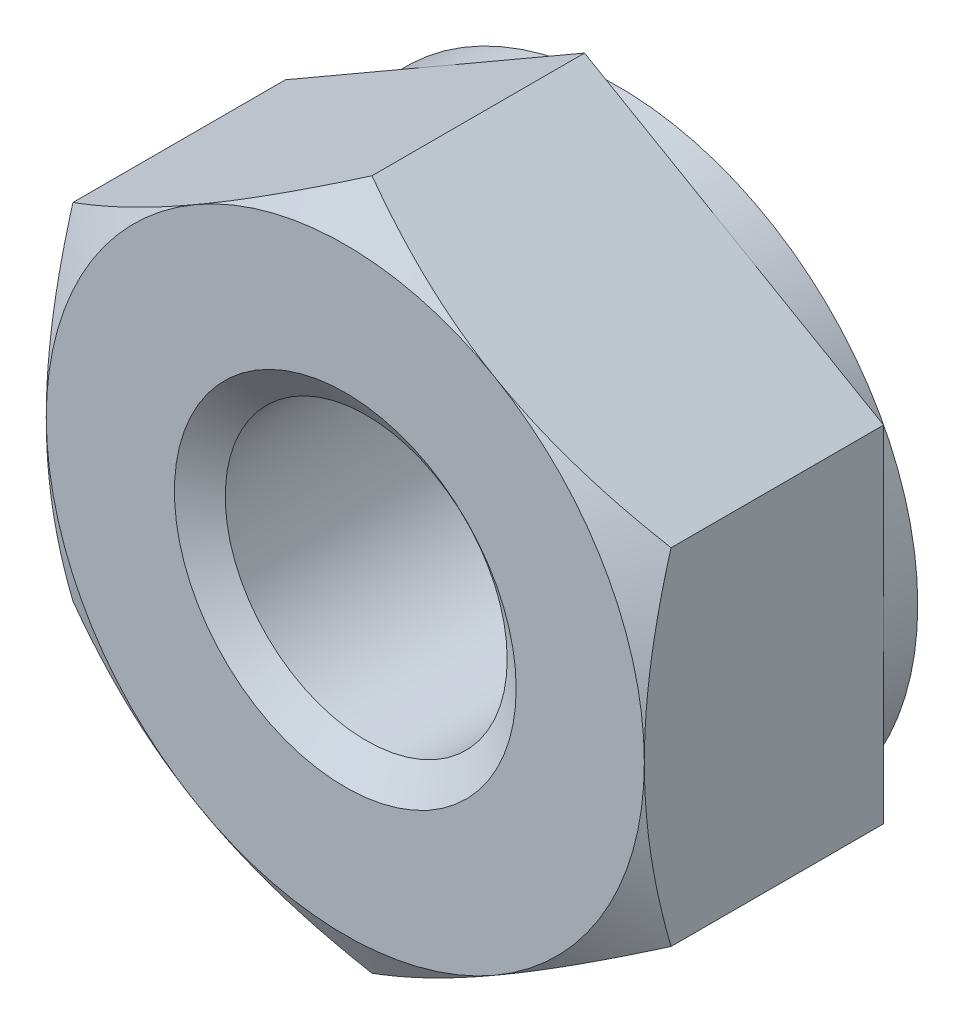
ISO-10303-21;
HEADER;
FILE_DESCRIPTION(('STEP AP214'),'2;1');
FILE_NAME('part.step','',(''),(''),'','','');
FILE_SCHEMA(('AUTOMOTIVE_DESIGN { 1 0 10303 214 1 1 1 1 }'));
ENDSEC;
DATA;
#1=APPLICATION_CONTEXT('core data for automotive mechanical design processes');
#2=APPLICATION_PROTOCOL_DEFINITION('international standard','automotive_design',2000,#1);
#3=PRODUCT_CONTEXT('',#1,'mechanical');
#4=PRODUCT('Part','Part','',(#3));
#5=PRODUCT_RELATED_PRODUCT_CATEGORY('part','',(#4));
#6=PRODUCT_DEFINITION_FORMATION('','',#4);
#7=PRODUCT_DEFINITION_CONTEXT('part definition',#1,'design');
#8=PRODUCT_DEFINITION('design','',#6,#7);
#9=PRODUCT_DEFINITION_SHAPE('','',#8);
#10=(LENGTH_UNIT() NAMED_UNIT(*) SI_UNIT(.MILLI.,.METRE.));
#11=(NAMED_UNIT(*) PLANE_ANGLE_UNIT() SI_UNIT($,.RADIAN.));
#12=(NAMED_UNIT(*) SI_UNIT($,.STERADIAN.) SOLID_ANGLE_UNIT());
#13=UNCERTAINTY_MEASURE_WITH_UNIT(LENGTH_MEASURE(1.E-05),#10,'distance_accuracy_value','');
#14=(GEOMETRIC_REPRESENTATION_CONTEXT(3) GLOBAL_UNCERTAINTY_ASSIGNED_CONTEXT((#13)) GLOBAL_UNIT_ASSIGNED_CONTEXT((#10,
#11,#12)) REPRESENTATION_CONTEXT('',''));
#15=CARTESIAN_POINT('',(0.,0.,0.));
#16=DIRECTION('',(0.,0.,1.));
#17=DIRECTION('',(1.,0.,0.));
#18=AXIS2_PLACEMENT_3D('',#15,#16,#17);
#19=CARTESIAN_POINT('',(0.,0.,-3.2));
#20=DIRECTION('',(0.,0.,1.));
#21=DIRECTION('',(1.,0.,0.));
#22=AXIS2_PLACEMENT_3D('',#19,#20,#21);
#23=CYLINDRICAL_SURFACE('',#22,1.65);
#24=CARTESIAN_POINT('',(0.,0.,-0.2450726383734));
#25=DIRECTION('',(0.,0.,1.));
#26=DIRECTION('',(1.,0.,0.));
#27=AXIS2_PLACEMENT_3D('',#24,#25,#26);
#28=CIRCLE('',#27,1.65);
#29=CARTESIAN_POINT('',(1.65,0.,-0.2450726383734));
#30=VERTEX_POINT('',#29);
#31=EDGE_CURVE('E153',#30,#30,#28,.F.);
#32=ORIENTED_EDGE('',*,*,#31,.F.);
#33=EDGE_LOOP('',(#32));
#34=FACE_BOUND('',#33,.T.);
#35=CARTESIAN_POINT('',(0.,0.,-2.9295273616266));
#36=DIRECTION('',(0.,0.,-1.));
#37=DIRECTION('',(-1.,0.,0.));
#38=AXIS2_PLACEMENT_3D('',#35,#36,#37);
#39=CIRCLE('',#38,1.65);
#40=CARTESIAN_POINT('',(-1.65,0.,-2.9295273616266));
#41=VERTEX_POINT('',#40);
#42=EDGE_CURVE('E41',#41,#41,#39,.F.);
#43=ORIENTED_EDGE('',*,*,#42,.F.);
#44=EDGE_LOOP('',(#43));
#45=FACE_BOUND('',#44,.T.);
#46=ADVANCED_FACE('F36',(#34,#45),#23,.F.);
#47=CARTESIAN_POINT('',(0.,4.0414518843274,-3.2));
#48=DIRECTION('',(-0.500000000000005,0.866025403784436,0.));
#49=DIRECTION('',(-0.866025403784436,-0.500000000000005,0.));
#50=AXIS2_PLACEMENT_3D('',#47,#48,#49);
#51=PLANE('',#50);
#52=DIRECTION('',(0.,0.,1.));
#53=VECTOR('',#52,1.);
#54=CARTESIAN_POINT('',(-3.5,2.02072594216368,-3.2));
#55=LINE('',#54,#53);
#56=CARTESIAN_POINT('',(-3.5,2.02072594216368,-2.8));
#57=VERTEX_POINT('',#56);
#58=CARTESIAN_POINT('',(-3.5,2.02072594216368,-0.312607391169654));
#59=VERTEX_POINT('',#58);
#60=EDGE_CURVE('E291',#57,#59,#55,.T.);
#61=ORIENTED_EDGE('',*,*,#60,.T.);
#62=CARTESIAN_POINT('',(-3.5002,2.02061047210984,-0.312674060693369));
#63=CARTESIAN_POINT('',(-3.34639282154755,2.10941108799266,-0.261385788989981));
#64=CARTESIAN_POINT('',(-3.19125798916558,2.19897822522908,-0.214740953816195));
#65=CARTESIAN_POINT('',(-2.87830199342322,2.37966345361544,-0.133321875533347));
#66=CARTESIAN_POINT('',(-2.72047526921251,2.47078475532382,-0.0985764355845604));
#67=CARTESIAN_POINT('',(-2.40677778961988,2.65189807961073,-0.0444900271828359));
#68=CARTESIAN_POINT('',(-2.25095530083931,2.74186223545399,-0.0247890862603818));
#69=CARTESIAN_POINT('',(-1.93857711279463,2.92221386641055,-0.00127013273725549));
#70=CARTESIAN_POINT('',(-1.78202254896578,3.01260068598001,0.00256735545443312));
#71=CARTESIAN_POINT('',(-1.48949078007902,3.1814939814933,-0.00541530187698026));
#72=CARTESIAN_POINT('',(-1.3534697875421,3.26002573814993,-0.0152754340696102));
#73=CARTESIAN_POINT('',(-1.08231397971101,3.41657761679354,-0.0465264668994079));
#74=CARTESIAN_POINT('',(-0.947180102315322,3.49459719728458,-0.0679280432858034));
#75=CARTESIAN_POINT('',(-0.67546520759482,3.6514718648943,-0.121430407880584));
#76=CARTESIAN_POINT('',(-0.538918580721667,3.73030709667645,-0.153757994445094));
#77=CARTESIAN_POINT('',(-0.2678619070555,3.88680174018326,-0.227128933808003));
#78=CARTESIAN_POINT('',(-0.133348387531465,3.9644631568901,-0.268155046569876));
#79=CARTESIAN_POINT('',(0.000199999999998829,4.04156735438124,-0.312674060693381));
#80=B_SPLINE_CURVE_WITH_KNOTS('',3,(#62,#63,#64,#65,#66,#67,#68,#69,#70,#71,#72,#73,#74,#75,#76,
#77,#78,#79),.UNSPECIFIED.,.F.,.F.,(4,2,2,2,2,2,2,2,4),(0.,0.554793832886253,1.11092123814984,
1.65328467083219,2.19498204478403,2.6666513085086,3.13875761298268,3.62133612600511,
4.10296698719188),.UNSPECIFIED.);
#81=CARTESIAN_POINT('',(-1.75000000000002,3.03108891324552,0.));
#82=VERTEX_POINT('',#81);
#83=EDGE_CURVE('E139',#59,#82,#80,.T.);
#84=ORIENTED_EDGE('',*,*,#83,.T.);
#85=CARTESIAN_POINT('',(0.,4.0414518843274,-0.312607391169653));
#86=VERTEX_POINT('',#85);
#87=EDGE_CURVE('E166',#82,#86,#80,.T.);
#88=ORIENTED_EDGE('',*,*,#87,.T.);
#89=DIRECTION('',(0.,0.,1.));
#90=VECTOR('',#89,1.);
#91=CARTESIAN_POINT('',(0.,4.0414518843274,-3.2));
#92=LINE('',#91,#90);
#93=CARTESIAN_POINT('',(0.,4.0414518843274,-2.8));
#94=VERTEX_POINT('',#93);
#95=EDGE_CURVE('E279',#94,#86,#92,.T.);
#96=ORIENTED_EDGE('',*,*,#95,.F.);
#97=DIRECTION('',(-0.866025403784436,-0.500000000000005,0.));
#98=VECTOR('',#97,1.);
#99=CARTESIAN_POINT('',(0.,4.0414518843274,-2.8));
#100=LINE('',#99,#98);
#101=CARTESIAN_POINT('',(-1.75000000000002,3.03108891324553,-2.8));
#102=VERTEX_POINT('',#101);
#103=EDGE_CURVE('E267',#94,#102,#100,.T.);
#104=ORIENTED_EDGE('',*,*,#103,.T.);
#105=EDGE_CURVE('E263',#102,#57,#100,.T.);
#106=ORIENTED_EDGE('',*,*,#105,.T.);
#107=EDGE_LOOP('',(#61,#84,#88,#96,#104,#106));
#108=FACE_BOUND('',#107,.T.);
#109=ADVANCED_FACE('F38',(#108),#51,.T.);
#110=CARTESIAN_POINT('',(3.5,2.02072594216367,-3.2));
#111=DIRECTION('',(0.500000000000006,0.866025403784435,0.));
#112=DIRECTION('',(-0.866025403784435,0.500000000000006,0.));
#113=AXIS2_PLACEMENT_3D('',#110,#111,#112);
#114=PLANE('',#113);
#115=ORIENTED_EDGE('',*,*,#95,.T.);
#116=CARTESIAN_POINT('',(-0.000200000000001219,4.04156735438124,-0.312674060693381));
#117=CARTESIAN_POINT('',(0.153607178452449,3.95276673849842,-0.261385788989993));
#118=CARTESIAN_POINT('',(0.308742010834423,3.86319960126199,-0.214740953816206));
#119=CARTESIAN_POINT('',(0.62169800657678,3.68251437287563,-0.133321875533355));
#120=CARTESIAN_POINT('',(0.779524730787494,3.59139307116726,-0.0985764355845668));
#121=CARTESIAN_POINT('',(1.09322221038013,3.41027974688034,-0.0444900271828393));
#122=CARTESIAN_POINT('',(1.24904469916069,3.32031559103708,-0.0247890862603838));
#123=CARTESIAN_POINT('',(1.56142288720537,3.13996396008052,-0.00127013273725479));
#124=CARTESIAN_POINT('',(1.71797745103423,3.04957714051106,0.00256735545443512));
#125=CARTESIAN_POINT('',(2.01050921992099,2.88068384499777,-0.00541530187697601));
#126=CARTESIAN_POINT('',(2.1465302124579,2.80215208834114,-0.0152754340696049));
#127=CARTESIAN_POINT('',(2.41768602028899,2.64560020969753,-0.0465264668994002));
#128=CARTESIAN_POINT('',(2.55281989768468,2.56758062920649,-0.0679280432857943));
#129=CARTESIAN_POINT('',(2.82453479240518,2.41070596159677,-0.121430407880572));
#130=CARTESIAN_POINT('',(2.96108141927833,2.33187072981462,-0.153757994445082));
#131=CARTESIAN_POINT('',(3.2321380929445,2.17537608630782,-0.227128933807989));
#132=CARTESIAN_POINT('',(3.36665161246853,2.09771466960097,-0.268155046569861));
#133=CARTESIAN_POINT('',(3.5002,2.02061047210984,-0.312674060693365));
#134=B_SPLINE_CURVE_WITH_KNOTS('',3,(#116,#117,#118,#119,#120,#121,#122,#123,#124,#125,#126,
#127,#128,#129,#130,#131,#132,#133),.UNSPECIFIED.,.F.,.F.,(4,2,2,2,2,2,2,2,4),(0.,
0.554793832886256,1.11092123814984,1.65328467083219,2.19498204478404,2.66665130850861,
3.13875761298268,3.62133612600511,4.10296698719189),.UNSPECIFIED.);
#135=CARTESIAN_POINT('',(1.75000000000002,3.03108891324552,0.));
#136=VERTEX_POINT('',#135);
#137=EDGE_CURVE('E162',#86,#136,#134,.T.);
#138=ORIENTED_EDGE('',*,*,#137,.T.);
#139=CARTESIAN_POINT('',(3.5,2.02072594216373,-0.312607391169653));
#140=VERTEX_POINT('',#139);
#141=EDGE_CURVE('E148',#136,#140,#134,.T.);
#142=ORIENTED_EDGE('',*,*,#141,.T.);
#143=DIRECTION('',(0.,0.,1.));
#144=VECTOR('',#143,1.);
#145=CARTESIAN_POINT('',(3.5,2.02072594216367,-3.2));
#146=LINE('',#145,#144);
#147=CARTESIAN_POINT('',(3.5,2.02072594216367,-2.8));
#148=VERTEX_POINT('',#147);
#149=EDGE_CURVE('E161',#148,#140,#146,.T.);
#150=ORIENTED_EDGE('',*,*,#149,.F.);
#151=DIRECTION('',(-0.866025403784435,0.500000000000006,0.));
#152=VECTOR('',#151,1.);
#153=CARTESIAN_POINT('',(3.5,2.02072594216367,-2.8));
#154=LINE('',#153,#152);
#155=CARTESIAN_POINT('',(1.75000000000002,3.03108891324552,-2.8));
#156=VERTEX_POINT('',#155);
#157=EDGE_CURVE('E275',#148,#156,#154,.T.);
#158=ORIENTED_EDGE('',*,*,#157,.T.);
#159=EDGE_CURVE('E271',#156,#94,#154,.T.);
#160=ORIENTED_EDGE('',*,*,#159,.T.);
#161=EDGE_LOOP('',(#115,#138,#142,#150,#158,#160));
#162=FACE_BOUND('',#161,.T.);
#163=ADVANCED_FACE('F238',(#162),#114,.T.);
#164=CARTESIAN_POINT('',(3.5,2.02072594216367,-3.2));
#165=DIRECTION('',(-1.,0.,0.));
#166=DIRECTION('',(0.,0.,1.));
#167=AXIS2_PLACEMENT_3D('',#164,#165,#166);
#168=PLANE('',#167);
#169=CARTESIAN_POINT('',(3.5,-5.35926299121408,-1.67484346858557));
#170=CARTESIAN_POINT('',(3.5,-5.20559319908844,-1.60058173692105));
#171=CARTESIAN_POINT('',(3.5,-5.05156008083378,-1.52705822833148));
#172=CARTESIAN_POINT('',(3.5,-4.74257074180713,-1.38190950344753));
#173=CARTESIAN_POINT('',(3.5,-4.58761436682439,-1.31028461582134));
#174=CARTESIAN_POINT('',(3.5,-4.27574500225545,-1.16897765517625));
#175=CARTESIAN_POINT('',(3.5,-4.11882589028194,-1.09930904568017));
#176=CARTESIAN_POINT('',(3.5,-3.80369792903858,-0.962964262242769));
#177=CARTESIAN_POINT('',(3.5,-3.64548914750598,-0.896287932319526));
#178=CARTESIAN_POINT('',(3.5,-3.32556618401858,-0.765931819095075));
#179=CARTESIAN_POINT('',(3.5,-3.16383281219926,-0.702298873688873));
#180=CARTESIAN_POINT('',(3.5,-2.838458409456,-0.580016702089499));
#181=CARTESIAN_POINT('',(3.5,-2.67481716858828,-0.521368030370698));
#182=CARTESIAN_POINT('',(3.5,-2.34570278472052,-0.410630279877027));
#183=CARTESIAN_POINT('',(3.5,-2.18023438248745,-0.358527255435863));
#184=CARTESIAN_POINT('',(3.5,-1.84694522806372,-0.262572936976447));
#185=CARTESIAN_POINT('',(3.5,-1.67912523787532,-0.218719033467162));
#186=CARTESIAN_POINT('',(3.5,-1.34101828610927,-0.141391945584789));
#187=CARTESIAN_POINT('',(3.5,-1.17073068027696,-0.107921525211975));
#188=CARTESIAN_POINT('',(3.5,-0.828102385138507,-0.0536149564320514));
#189=CARTESIAN_POINT('',(3.5,-0.655761694017324,-0.0327788191952368));
#190=CARTESIAN_POINT('',(3.5,-0.311020490924471,-0.00558408650575574));
#191=CARTESIAN_POINT('',(3.5,-0.138627397207281,0.000866163165912722));
#192=CARTESIAN_POINT('',(3.5,0.206038074906514,-0.00105355807794355));
#193=CARTESIAN_POINT('',(3.5,0.378310473023158,-0.00941968196342874));
#194=CARTESIAN_POINT('',(3.5,0.672490555822305,-0.0357688927868878));
#195=CARTESIAN_POINT('',(3.5,0.79472279108407,-0.0503206340384166));
#196=CARTESIAN_POINT('',(3.5,1.03824305430558,-0.0859367340533499));
#197=CARTESIAN_POINT('',(3.5,1.15953093025884,-0.107002119926135));
#198=CARTESIAN_POINT('',(3.5,1.52187914771345,-0.178863187081444));
#199=CARTESIAN_POINT('',(3.5,1.76124104212629,-0.238305275622001));
#200=CARTESIAN_POINT('',(3.5,2.11940971387705,-0.340826814402543));
#201=CARTESIAN_POINT('',(3.5,2.24008344316343,-0.377749699085172));
#202=CARTESIAN_POINT('',(3.5,2.48017139213725,-0.455249007699281));
#203=CARTESIAN_POINT('',(3.5,2.5995864179561,-0.495822911663537));
#204=CARTESIAN_POINT('',(3.5,2.83665760451795,-0.579779986782738));
#205=CARTESIAN_POINT('',(3.5,2.9543198820348,-0.6231460600343));
#206=CARTESIAN_POINT('',(3.5,3.18873153508797,-0.712423559566851));
#207=CARTESIAN_POINT('',(3.5,3.30548051959461,-0.758336014592934));
#208=CARTESIAN_POINT('',(3.5,3.42180736613345,-0.805270380724054));
#209=B_SPLINE_CURVE_WITH_KNOTS('',3,(#169,#170,#171,#172,#173,#174,#175,#176,#177,#178,#179,
#180,#181,#182,#183,#184,#185,#186,#187,#188,#189,#190,#191,#192,#193,#194,#195,#196,#197,#198,
#199,#200,#201,#202,#203,#204,#205,#206,#207,#208),.UNSPECIFIED.,.F.,.F.,(4,2,2,2,2,2,2,2,2,2,2,
2,2,2,2,2,2,2,2,4),(0.,0.512025318465738,1.02413870177436,1.53918270315241,2.05419982499223,
2.57553975872798,3.09693761309353,3.61720506610401,4.13730766217538,4.65754858684365,
5.17778997146962,5.69470725122283,6.21149033452401,6.58059623222332,6.94976036239485,
7.68863804939851,8.06719621660478,8.4454950747676,8.82166461280098,9.19798724733409),.UNSPECIFIED.);
#210=CARTESIAN_POINT('',(3.50000000000001,-2.02072594216371,-0.312607391169653));
#211=VERTEX_POINT('',#210);
#212=CARTESIAN_POINT('',(3.5,0.,0.));
#213=VERTEX_POINT('',#212);
#214=EDGE_CURVE('E128',#211,#213,#209,.T.);
#215=ORIENTED_EDGE('',*,*,#214,.F.);
#216=DIRECTION('',(0.,0.,1.));
#217=VECTOR('',#216,1.);
#218=CARTESIAN_POINT('',(3.5,-2.02072594216372,-3.2));
#219=LINE('',#218,#217);
#220=CARTESIAN_POINT('',(3.5,-2.02072594216372,-2.8));
#221=VERTEX_POINT('',#220);
#222=EDGE_CURVE('E284',#221,#211,#219,.T.);
#223=ORIENTED_EDGE('',*,*,#222,.F.);
#224=DIRECTION('',(0.,-1.,0.));
#225=VECTOR('',#224,1.);
#226=CARTESIAN_POINT('',(3.5,2.02072594216367,-2.8));
#227=LINE('',#226,#225);
#228=CARTESIAN_POINT('',(3.5,0.,-2.8));
#229=VERTEX_POINT('',#228);
#230=EDGE_CURVE('E276',#229,#221,#227,.T.);
#231=ORIENTED_EDGE('',*,*,#230,.F.);
#232=EDGE_CURVE('E278',#148,#229,#227,.T.);
#233=ORIENTED_EDGE('',*,*,#232,.F.);
#234=ORIENTED_EDGE('',*,*,#149,.T.);
#235=EDGE_CURVE('E141',#213,#140,#209,.T.);
#236=ORIENTED_EDGE('',*,*,#235,.F.);
#237=EDGE_LOOP('',(#215,#223,#231,#233,#234,#236));
#238=FACE_BOUND('',#237,.T.);
#239=ADVANCED_FACE('F158',(#238),#168,.F.);
#240=CARTESIAN_POINT('',(0.,-4.04145188432744,-3.2));
#241=DIRECTION('',(0.500000000000005,-0.866025403784435,0.));
#242=DIRECTION('',(0.866025403784436,0.500000000000005,0.));
#243=AXIS2_PLACEMENT_3D('',#240,#241,#242);
#244=PLANE('',#243);
#245=ORIENTED_EDGE('',*,*,#222,.T.);
#246=CARTESIAN_POINT('',(3.5002,-2.02061047210988,-0.312674060693378));
#247=CARTESIAN_POINT('',(3.34639282154755,-2.1094110879927,-0.261385788989991));
#248=CARTESIAN_POINT('',(3.19125798916557,-2.19897822522912,-0.214740953816205));
#249=CARTESIAN_POINT('',(2.87830199342321,-2.37966345361548,-0.133321875533359));
#250=CARTESIAN_POINT('',(2.7204752692125,-2.47078475532386,-0.0985764355845728));
#251=CARTESIAN_POINT('',(2.40677778961987,-2.65189807961077,-0.0444900271828499));
#252=CARTESIAN_POINT('',(2.2509553008393,-2.74186223545403,-0.0247890862603968));
#253=CARTESIAN_POINT('',(1.93857711279462,-2.9222138664106,-0.0012701327372723));
#254=CARTESIAN_POINT('',(1.78202254896576,-3.01260068598005,0.0025673554544155));
#255=CARTESIAN_POINT('',(1.48949078007901,-3.18149398149334,-0.00541530187699944));
#256=CARTESIAN_POINT('',(1.35346978754209,-3.26002573814997,-0.01527543406963));
#257=CARTESIAN_POINT('',(1.082313979711,-3.41657761679358,-0.0465264668994288));
#258=CARTESIAN_POINT('',(0.947180102315312,-3.49459719728462,-0.0679280432858246));
#259=CARTESIAN_POINT('',(0.675465207594812,-3.65147186489434,-0.121430407880606));
#260=CARTESIAN_POINT('',(0.53891858072166,-3.73030709667649,-0.153757994445116));
#261=CARTESIAN_POINT('',(0.267861907055495,-3.8868017401833,-0.227128933808025));
#262=CARTESIAN_POINT('',(0.13334838753146,-3.96446315689014,-0.268155046569898));
#263=CARTESIAN_POINT('',(-0.000200000000003079,-4.04156735438127,-0.312674060693403));
#264=B_SPLINE_CURVE_WITH_KNOTS('',3,(#246,#247,#248,#249,#250,#251,#252,#253,#254,#255,#256,
#257,#258,#259,#260,#261,#262,#263),.UNSPECIFIED.,.F.,.F.,(4,2,2,2,2,2,2,2,4),(0.,
0.554793832886255,1.11092123814984,1.65328467083219,2.19498204478404,2.66665130850861,
3.13875761298268,3.62133612600511,4.10296698719188),.UNSPECIFIED.);
#265=CARTESIAN_POINT('',(1.75000000000002,-3.03108891324552,0.));
#266=VERTEX_POINT('',#265);
#267=EDGE_CURVE('E134',#211,#266,#264,.T.);
#268=ORIENTED_EDGE('',*,*,#267,.T.);
#269=CARTESIAN_POINT('',(0.,-4.0414518843274,-0.312607391169653));
#270=VERTEX_POINT('',#269);
#271=EDGE_CURVE('E55',#266,#270,#264,.T.);
#272=ORIENTED_EDGE('',*,*,#271,.T.);
#273=DIRECTION('',(0.,0.,1.));
#274=VECTOR('',#273,1.);
#275=CARTESIAN_POINT('',(0.,-4.04145188432744,-3.2));
#276=LINE('',#275,#274);
#277=CARTESIAN_POINT('',(0.,-4.04145188432744,-2.8));
#278=VERTEX_POINT('',#277);
#279=EDGE_CURVE('E286',#278,#270,#276,.T.);
#280=ORIENTED_EDGE('',*,*,#279,.F.);
#281=DIRECTION('',(0.866025403784436,0.500000000000005,0.));
#282=VECTOR('',#281,1.);
#283=CARTESIAN_POINT('',(0.,-4.04145188432744,-2.8));
#284=LINE('',#283,#282);
#285=CARTESIAN_POINT('',(1.75000000000004,-3.03108891324555,-2.8));
#286=VERTEX_POINT('',#285);
#287=EDGE_CURVE('E268',#278,#286,#284,.T.);
#288=ORIENTED_EDGE('',*,*,#287,.T.);
#289=EDGE_CURVE('E272',#286,#221,#284,.T.);
#290=ORIENTED_EDGE('',*,*,#289,.T.);
#291=EDGE_LOOP('',(#245,#268,#272,#280,#288,#290));
#292=FACE_BOUND('',#291,.T.);
#293=ADVANCED_FACE('F219',(#292),#244,.T.);
#294=CARTESIAN_POINT('',(-3.5,-2.02072594216371,-3.2));
#295=DIRECTION('',(-0.500000000000006,-0.866025403784435,0.));
#296=DIRECTION('',(0.866025403784435,-0.500000000000006,0.));
#297=AXIS2_PLACEMENT_3D('',#294,#295,#296);
#298=PLANE('',#297);
#299=ORIENTED_EDGE('',*,*,#279,.T.);
#300=CARTESIAN_POINT('',(0.000199999999996763,-4.04156735438127,-0.312674060693403));
#301=CARTESIAN_POINT('',(-0.153607178452454,-3.95276673849845,-0.261385788990014));
#302=CARTESIAN_POINT('',(-0.30874201083443,-3.86319960126203,-0.214740953816227));
#303=CARTESIAN_POINT('',(-0.62169800657679,-3.68251437287567,-0.133321875533376));
#304=CARTESIAN_POINT('',(-0.779524730787506,-3.59139307116729,-0.0985764355845873));
#305=CARTESIAN_POINT('',(-1.09322221038014,-3.41027974688037,-0.0444900271828596));
#306=CARTESIAN_POINT('',(-1.24904469916071,-3.32031559103712,-0.024789086260404));
#307=CARTESIAN_POINT('',(-1.56142288720539,-3.13996396008055,-0.00127013273727487));
#308=CARTESIAN_POINT('',(-1.71797745103425,-3.04957714051109,0.00256735545441511));
#309=CARTESIAN_POINT('',(-2.01050921992101,-2.8806838449978,-0.00541530187699609));
#310=CARTESIAN_POINT('',(-2.14653021245792,-2.80215208834117,-0.0152754340696248));
#311=CARTESIAN_POINT('',(-2.41768602028901,-2.64560020969756,-0.0465264668994196));
#312=CARTESIAN_POINT('',(-2.55281989768469,-2.56758062920652,-0.0679280432858133));
#313=CARTESIAN_POINT('',(-2.82453479240519,-2.41070596159681,-0.12143040788059));
#314=CARTESIAN_POINT('',(-2.96108141927834,-2.33187072981466,-0.153757994445099));
#315=CARTESIAN_POINT('',(-3.2321380929445,-2.17537608630785,-0.227128933808003));
#316=CARTESIAN_POINT('',(-3.36665161246854,-2.09771466960101,-0.268155046569875));
#317=CARTESIAN_POINT('',(-3.5002,-2.02061047210988,-0.312674060693378));
#318=B_SPLINE_CURVE_WITH_KNOTS('',3,(#300,#301,#302,#303,#304,#305,#306,#307,#308,#309,#310,
#311,#312,#313,#314,#315,#316,#317),.UNSPECIFIED.,.F.,.F.,(4,2,2,2,2,2,2,2,4),(0.,
0.554793832886261,1.11092123814985,1.65328467083221,2.19498204478406,2.66665130850863,
3.13875761298269,3.62133612600511,4.10296698719188),.UNSPECIFIED.);
#319=CARTESIAN_POINT('',(-1.75000000000002,-3.03108891324552,0.));
#320=VERTEX_POINT('',#319);
#321=EDGE_CURVE('E213',#270,#320,#318,.T.);
#322=ORIENTED_EDGE('',*,*,#321,.T.);
#323=CARTESIAN_POINT('',(-3.5,-2.02072594216372,-0.312607391169653));
#324=VERTEX_POINT('',#323);
#325=EDGE_CURVE('E62',#320,#324,#318,.T.);
#326=ORIENTED_EDGE('',*,*,#325,.T.);
#327=DIRECTION('',(0.,0.,1.));
#328=VECTOR('',#327,1.);
#329=CARTESIAN_POINT('',(-3.5,-2.02072594216371,-3.2));
#330=LINE('',#329,#328);
#331=CARTESIAN_POINT('',(-3.5,-2.02072594216371,-2.8));
#332=VERTEX_POINT('',#331);
#333=EDGE_CURVE('E289',#332,#324,#330,.T.);
#334=ORIENTED_EDGE('',*,*,#333,.F.);
#335=DIRECTION('',(0.866025403784435,-0.500000000000006,0.));
#336=VECTOR('',#335,1.);
#337=CARTESIAN_POINT('',(-3.5,-2.02072594216371,-2.8));
#338=LINE('',#337,#336);
#339=CARTESIAN_POINT('',(-1.75000000000004,-3.03108891324555,-2.8));
#340=VERTEX_POINT('',#339);
#341=EDGE_CURVE('E258',#332,#340,#338,.T.);
#342=ORIENTED_EDGE('',*,*,#341,.T.);
#343=EDGE_CURVE('E264',#340,#278,#338,.T.);
#344=ORIENTED_EDGE('',*,*,#343,.T.);
#345=EDGE_LOOP('',(#299,#322,#326,#334,#342,#344));
#346=FACE_BOUND('',#345,.T.);
#347=ADVANCED_FACE('F215',(#346),#298,.T.);
#348=CARTESIAN_POINT('',(-3.5,2.02072594216368,-3.2));
#349=DIRECTION('',(-1.,0.,0.));
#350=DIRECTION('',(0.,0.,1.));
#351=AXIS2_PLACEMENT_3D('',#348,#349,#350);
#352=PLANE('',#351);
#353=ORIENTED_EDGE('',*,*,#333,.T.);
#354=CARTESIAN_POINT('',(-3.5,-5.35926299121408,-1.67484346858557));
#355=CARTESIAN_POINT('',(-3.5,-5.20559319908844,-1.60058173692105));
#356=CARTESIAN_POINT('',(-3.5,-5.05156008083378,-1.52705822833148));
#357=CARTESIAN_POINT('',(-3.5,-4.74257074180712,-1.38190950344753));
#358=CARTESIAN_POINT('',(-3.5,-4.58761436682439,-1.31028461582134));
#359=CARTESIAN_POINT('',(-3.5,-4.27574500225544,-1.16897765517625));
#360=CARTESIAN_POINT('',(-3.5,-4.11882589028194,-1.09930904568017));
#361=CARTESIAN_POINT('',(-3.5,-3.80369792903858,-0.962964262242769));
#362=CARTESIAN_POINT('',(-3.5,-3.64548914750597,-0.896287932319527));
#363=CARTESIAN_POINT('',(-3.5,-3.32556618401857,-0.765931819095075));
#364=CARTESIAN_POINT('',(-3.5,-3.16383281219926,-0.702298873688873));
#365=CARTESIAN_POINT('',(-3.5,-2.83845840945599,-0.5800167020895));
#366=CARTESIAN_POINT('',(-3.5,-2.67481716858828,-0.521368030370698));
#367=CARTESIAN_POINT('',(-3.5,-2.34570278472051,-0.410630279877028));
#368=CARTESIAN_POINT('',(-3.5,-2.18023438248744,-0.358527255435863));
#369=CARTESIAN_POINT('',(-3.5,-1.84694522806372,-0.262572936976448));
#370=CARTESIAN_POINT('',(-3.5,-1.67912523787532,-0.218719033467163));
#371=CARTESIAN_POINT('',(-3.5,-1.34101828610927,-0.14139194558479));
#372=CARTESIAN_POINT('',(-3.5,-1.17073068027695,-0.107921525211976));
#373=CARTESIAN_POINT('',(-3.5,-0.828102385138502,-0.0536149564320528));
#374=CARTESIAN_POINT('',(-3.5,-0.655761694017319,-0.0327788191952384));
#375=CARTESIAN_POINT('',(-3.5,-0.311020490924466,-0.00558408650575762));
#376=CARTESIAN_POINT('',(-3.5,-0.138627397207275,0.000866163165910837));
#377=CARTESIAN_POINT('',(-3.5,0.20603807490652,-0.00105355807794567));
#378=CARTESIAN_POINT('',(-3.5,0.378310473023165,-0.00941968196343106));
#379=CARTESIAN_POINT('',(-3.5,0.672490555822312,-0.0357688927868905));
#380=CARTESIAN_POINT('',(-3.5,0.794722791084076,-0.0503206340384194));
#381=CARTESIAN_POINT('',(-3.5,1.03824305430558,-0.085936734053353));
#382=CARTESIAN_POINT('',(-3.5,1.15953093025885,-0.107002119926138));
#383=CARTESIAN_POINT('',(-3.5,1.52187914771346,-0.178863187081448));
#384=CARTESIAN_POINT('',(-3.5,1.7612410421263,-0.238305275622005));
#385=CARTESIAN_POINT('',(-3.5,2.11940971387707,-0.340826814402548));
#386=CARTESIAN_POINT('',(-3.5,2.24008344316344,-0.377749699085177));
#387=CARTESIAN_POINT('',(-3.5,2.48017139213726,-0.455249007699287));
#388=CARTESIAN_POINT('',(-3.5,2.59958641795611,-0.495822911663543));
#389=CARTESIAN_POINT('',(-3.5,2.83665760451796,-0.579779986782744));
#390=CARTESIAN_POINT('',(-3.5,2.95431988203481,-0.623146060034306));
#391=CARTESIAN_POINT('',(-3.5,3.18873153508798,-0.712423559566857));
#392=CARTESIAN_POINT('',(-3.5,3.30548051959462,-0.758336014592941));
#393=CARTESIAN_POINT('',(-3.5,3.42180736613347,-0.805270380724061));
#394=B_SPLINE_CURVE_WITH_KNOTS('',3,(#354,#355,#356,#357,#358,#359,#360,#361,#362,#363,#364,
#365,#366,#367,#368,#369,#370,#371,#372,#373,#374,#375,#376,#377,#378,#379,#380,#381,#382,#383,
#384,#385,#386,#387,#388,#389,#390,#391,#392,#393),.UNSPECIFIED.,.F.,.F.,(4,2,2,2,2,2,2,2,2,2,2,
2,2,2,2,2,2,2,2,4),(0.,0.512025318465737,1.02413870177436,1.53918270315241,2.05419982499224,
2.57553975872798,3.09693761309353,3.61720506610401,4.13730766217538,4.65754858684365,
5.17778997146962,5.69470725122283,6.21149033452401,6.58059623222332,6.94976036239485,
7.68863804939851,8.06719621660478,8.44549507476761,8.82166461280099,9.19798724733411),.UNSPECIFIED.);
#395=CARTESIAN_POINT('',(-3.5,0.,0.));
#396=VERTEX_POINT('',#395);
#397=EDGE_CURVE('E214',#324,#396,#394,.T.);
#398=ORIENTED_EDGE('',*,*,#397,.T.);
#399=EDGE_CURVE('E152',#396,#59,#394,.T.);
#400=ORIENTED_EDGE('',*,*,#399,.T.);
#401=ORIENTED_EDGE('',*,*,#60,.F.);
#402=DIRECTION('',(0.,-1.,0.));
#403=VECTOR('',#402,1.);
#404=CARTESIAN_POINT('',(-3.5,2.02072594216368,-2.8));
#405=LINE('',#404,#403);
#406=CARTESIAN_POINT('',(-3.5,0.,-2.8));
#407=VERTEX_POINT('',#406);
#408=EDGE_CURVE('E298',#57,#407,#405,.T.);
#409=ORIENTED_EDGE('',*,*,#408,.T.);
#410=EDGE_CURVE('E296',#407,#332,#405,.T.);
#411=ORIENTED_EDGE('',*,*,#410,.T.);
#412=EDGE_LOOP('',(#353,#398,#400,#401,#409,#411));
#413=FACE_BOUND('',#412,.T.);
#414=ADVANCED_FACE('F218',(#413),#352,.T.);
#415=CARTESIAN_POINT('',(-6.99999999999995,0.,0.));
#416=DIRECTION('',(0.,0.,1.));
#417=DIRECTION('',(1.,0.,0.));
#418=AXIS2_PLACEMENT_3D('',#415,#416,#417);
#419=PLANE('',#418);
#420=CARTESIAN_POINT('',(0.,0.,0.));
#421=DIRECTION('',(0.,0.,1.));
#422=DIRECTION('',(1.,0.,0.));
#423=AXIS2_PLACEMENT_3D('',#420,#421,#422);
#424=CIRCLE('',#423,2.);
#425=CARTESIAN_POINT('',(2.,0.,0.));
#426=VERTEX_POINT('',#425);
#427=EDGE_CURVE('E301',#426,#426,#424,.T.);
#428=ORIENTED_EDGE('',*,*,#427,.F.);
#429=EDGE_LOOP('',(#428));
#430=FACE_BOUND('',#429,.T.);
#431=CARTESIAN_POINT('',(0.,0.,0.));
#432=DIRECTION('',(0.,0.,1.));
#433=DIRECTION('',(1.,0.,0.));
#434=AXIS2_PLACEMENT_3D('',#431,#432,#433);
#435=CIRCLE('',#434,3.5);
#436=EDGE_CURVE('E12',#213,#266,#435,.F.);
#437=ORIENTED_EDGE('',*,*,#436,.F.);
#438=CARTESIAN_POINT('',(0.,0.,0.));
#439=DIRECTION('',(0.,0.,1.));
#440=DIRECTION('',(1.,0.,0.));
#441=AXIS2_PLACEMENT_3D('',#438,#439,#440);
#442=CIRCLE('',#441,3.5);
#443=EDGE_CURVE('E145',#213,#136,#442,.T.);
#444=ORIENTED_EDGE('',*,*,#443,.T.);
#445=EDGE_CURVE('E48',#82,#136,#435,.F.);
#446=ORIENTED_EDGE('',*,*,#445,.F.);
#447=EDGE_CURVE('E366',#396,#82,#435,.F.);
#448=ORIENTED_EDGE('',*,*,#447,.F.);
#449=EDGE_CURVE('E368',#320,#396,#435,.F.);
#450=ORIENTED_EDGE('',*,*,#449,.F.);
#451=EDGE_CURVE('E46',#266,#320,#435,.F.);
#452=ORIENTED_EDGE('',*,*,#451,.F.);
#453=EDGE_LOOP('',(#437,#444,#446,#448,#450,#452));
#454=FACE_BOUND('',#453,.T.);
#455=ADVANCED_FACE('F155',(#430,#454),#419,.T.);
#456=CARTESIAN_POINT('',(-6.99999999999995,0.,-3.2));
#457=DIRECTION('',(0.,0.,1.));
#458=DIRECTION('',(1.,0.,0.));
#459=AXIS2_PLACEMENT_3D('',#456,#457,#458);
#460=PLANE('',#459);
#461=CARTESIAN_POINT('',(0.,0.,-3.2));
#462=DIRECTION('',(0.,0.,1.));
#463=DIRECTION('',(1.,0.,0.));
#464=AXIS2_PLACEMENT_3D('',#461,#462,#463);
#465=CIRCLE('',#464,2.);
#466=CARTESIAN_POINT('',(2.,0.,-3.2));
#467=VERTEX_POINT('',#466);
#468=EDGE_CURVE('E302',#467,#467,#465,.F.);
#469=ORIENTED_EDGE('',*,*,#468,.F.);
#470=EDGE_LOOP('',(#469));
#471=FACE_BOUND('',#470,.T.);
#472=CARTESIAN_POINT('',(0.,0.,-3.2));
#473=DIRECTION('',(0.,0.,1.));
#474=DIRECTION('',(1.,0.,0.));
#475=AXIS2_PLACEMENT_3D('',#472,#473,#474);
#476=CIRCLE('',#475,3.5);
#477=CARTESIAN_POINT('',(3.5,0.,-3.2));
#478=VERTEX_POINT('',#477);
#479=EDGE_CURVE('E282',#478,#478,#476,.F.);
#480=ORIENTED_EDGE('',*,*,#479,.T.);
#481=EDGE_LOOP('',(#480));
#482=FACE_BOUND('',#481,.T.);
#483=ADVANCED_FACE('F228',(#471,#482),#460,.F.);
#484=CARTESIAN_POINT('',(0.,14.0414518843274,-2.8));
#485=DIRECTION('',(0.,0.,-1.));
#486=DIRECTION('',(-1.,0.,0.));
#487=AXIS2_PLACEMENT_3D('',#484,#485,#486);
#488=PLANE('',#487);
#489=ORIENTED_EDGE('',*,*,#232,.T.);
#490=CARTESIAN_POINT('',(0.,0.,-2.8));
#491=DIRECTION('',(0.,0.,1.));
#492=DIRECTION('',(1.,0.,0.));
#493=AXIS2_PLACEMENT_3D('',#490,#491,#492);
#494=CIRCLE('',#493,3.5);
#495=EDGE_CURVE('E255',#229,#156,#494,.T.);
#496=ORIENTED_EDGE('',*,*,#495,.T.);
#497=ORIENTED_EDGE('',*,*,#157,.F.);
#498=EDGE_LOOP('',(#489,#496,#497));
#499=FACE_BOUND('',#498,.T.);
#500=ADVANCED_FACE('F245',(#499),#488,.T.);
#501=ORIENTED_EDGE('',*,*,#230,.T.);
#502=ORIENTED_EDGE('',*,*,#289,.F.);
#503=EDGE_CURVE('E260',#286,#229,#494,.T.);
#504=ORIENTED_EDGE('',*,*,#503,.T.);
#505=EDGE_LOOP('',(#501,#502,#504));
#506=FACE_BOUND('',#505,.T.);
#507=ADVANCED_FACE('F344',(#506),#488,.T.);
#508=EDGE_CURVE('E259',#156,#102,#494,.T.);
#509=ORIENTED_EDGE('',*,*,#508,.T.);
#510=ORIENTED_EDGE('',*,*,#103,.F.);
#511=ORIENTED_EDGE('',*,*,#159,.F.);
#512=EDGE_LOOP('',(#509,#510,#511));
#513=FACE_BOUND('',#512,.T.);
#514=ADVANCED_FACE('F352',(#513),#488,.T.);
#515=ORIENTED_EDGE('',*,*,#343,.F.);
#516=EDGE_CURVE('E383',#340,#286,#494,.T.);
#517=ORIENTED_EDGE('',*,*,#516,.T.);
#518=ORIENTED_EDGE('',*,*,#287,.F.);
#519=EDGE_LOOP('',(#515,#517,#518));
#520=FACE_BOUND('',#519,.T.);
#521=ADVANCED_FACE('F347',(#520),#488,.T.);
#522=EDGE_CURVE('E356',#102,#407,#494,.T.);
#523=ORIENTED_EDGE('',*,*,#522,.T.);
#524=ORIENTED_EDGE('',*,*,#408,.F.);
#525=ORIENTED_EDGE('',*,*,#105,.F.);
#526=EDGE_LOOP('',(#523,#524,#525));
#527=FACE_BOUND('',#526,.T.);
#528=ADVANCED_FACE('F338',(#527),#488,.T.);
#529=CARTESIAN_POINT('',(0.,0.,0.));
#530=DIRECTION('',(0.,0.,1.));
#531=DIRECTION('',(1.,0.,0.));
#532=AXIS2_PLACEMENT_3D('',#529,#530,#531);
#533=CYLINDRICAL_SURFACE('',#532,3.5);
#534=ORIENTED_EDGE('',*,*,#479,.F.);
#535=EDGE_LOOP('',(#534));
#536=FACE_BOUND('',#535,.T.);
#537=ORIENTED_EDGE('',*,*,#508,.F.);
#538=ORIENTED_EDGE('',*,*,#495,.F.);
#539=ORIENTED_EDGE('',*,*,#503,.F.);
#540=ORIENTED_EDGE('',*,*,#516,.F.);
#541=EDGE_CURVE('E362',#407,#340,#494,.T.);
#542=ORIENTED_EDGE('',*,*,#541,.F.);
#543=ORIENTED_EDGE('',*,*,#522,.F.);
#544=EDGE_LOOP('',(#537,#538,#539,#540,#542,#543));
#545=FACE_BOUND('',#544,.T.);
#546=ADVANCED_FACE('F243',(#536,#545),#533,.T.);
#547=ORIENTED_EDGE('',*,*,#410,.F.);
#548=ORIENTED_EDGE('',*,*,#541,.T.);
#549=ORIENTED_EDGE('',*,*,#341,.F.);
#550=EDGE_LOOP('',(#547,#548,#549));
#551=FACE_BOUND('',#550,.T.);
#552=ADVANCED_FACE('F196',(#551),#488,.T.);
#553=CARTESIAN_POINT('',(0.,0.,0.));
#554=DIRECTION('',(0.,0.,-1.));
#555=DIRECTION('',(-1.,0.,0.));
#556=AXIS2_PLACEMENT_3D('',#553,#554,#555);
#557=CONICAL_SURFACE('',#556,3.5,1.0471975511966);
#558=ORIENTED_EDGE('',*,*,#443,.F.);
#559=ORIENTED_EDGE('',*,*,#235,.T.);
#560=ORIENTED_EDGE('',*,*,#141,.F.);
#561=EDGE_LOOP('',(#558,#559,#560));
#562=FACE_BOUND('',#561,.T.);
#563=ADVANCED_FACE('F146',(#562),#557,.T.);
#564=ORIENTED_EDGE('',*,*,#445,.T.);
#565=ORIENTED_EDGE('',*,*,#137,.F.);
#566=ORIENTED_EDGE('',*,*,#87,.F.);
#567=EDGE_LOOP('',(#564,#565,#566));
#568=FACE_BOUND('',#567,.T.);
#569=ADVANCED_FACE('F193',(#568),#557,.T.);
#570=ORIENTED_EDGE('',*,*,#399,.F.);
#571=ORIENTED_EDGE('',*,*,#447,.T.);
#572=ORIENTED_EDGE('',*,*,#83,.F.);
#573=EDGE_LOOP('',(#570,#571,#572));
#574=FACE_BOUND('',#573,.T.);
#575=ADVANCED_FACE('F192',(#574),#557,.T.);
#576=ORIENTED_EDGE('',*,*,#449,.T.);
#577=ORIENTED_EDGE('',*,*,#397,.F.);
#578=ORIENTED_EDGE('',*,*,#325,.F.);
#579=EDGE_LOOP('',(#576,#577,#578));
#580=FACE_BOUND('',#579,.T.);
#581=ADVANCED_FACE('F186',(#580),#557,.T.);
#582=ORIENTED_EDGE('',*,*,#451,.T.);
#583=ORIENTED_EDGE('',*,*,#321,.F.);
#584=ORIENTED_EDGE('',*,*,#271,.F.);
#585=EDGE_LOOP('',(#582,#583,#584));
#586=FACE_BOUND('',#585,.T.);
#587=ADVANCED_FACE('F191',(#586),#557,.T.);
#588=ORIENTED_EDGE('',*,*,#214,.T.);
#589=ORIENTED_EDGE('',*,*,#436,.T.);
#590=ORIENTED_EDGE('',*,*,#267,.F.);
#591=EDGE_LOOP('',(#588,#589,#590));
#592=FACE_BOUND('',#591,.T.);
#593=ADVANCED_FACE('F130',(#592),#557,.T.);
#594=CARTESIAN_POINT('',(0.,0.,-0.269579902210739));
#595=DIRECTION('',(0.,0.,1.));
#596=DIRECTION('',(1.,0.,0.));
#597=AXIS2_PLACEMENT_3D('',#594,#595,#596);
#598=CONICAL_SURFACE('',#597,1.615,0.959931088596872);
#599=ORIENTED_EDGE('',*,*,#427,.T.);
#600=EDGE_LOOP('',(#599));
#601=FACE_BOUND('',#600,.T.);
#602=ORIENTED_EDGE('',*,*,#31,.T.);
#603=EDGE_LOOP('',(#602));
#604=FACE_BOUND('',#603,.T.);
#605=ADVANCED_FACE('F194',(#601,#604),#598,.F.);
#606=CARTESIAN_POINT('',(0.,0.,-3.1746));
#607=DIRECTION('',(0.,0.,-1.));
#608=DIRECTION('',(-1.,0.,0.));
#609=AXIS2_PLACEMENT_3D('',#606,#607,#608);
#610=CONICAL_SURFACE('',#609,2.,0.95993108859688);
#611=CARTESIAN_POINT('',(0.,0.,-3.1746));
#612=DIRECTION('',(0.,0.,1.));
#613=DIRECTION('',(1.,0.,0.));
#614=AXIS2_PLACEMENT_3D('',#611,#612,#613);
#615=CIRCLE('',#614,2.);
#616=CARTESIAN_POINT('',(2.,0.,-3.1746));
#617=VERTEX_POINT('',#616);
#618=EDGE_CURVE('E304',#617,#617,#615,.T.);
#619=ORIENTED_EDGE('',*,*,#618,.F.);
#620=EDGE_LOOP('',(#619));
#621=FACE_BOUND('',#620,.T.);
#622=ORIENTED_EDGE('',*,*,#42,.T.);
#623=EDGE_LOOP('',(#622));
#624=FACE_BOUND('',#623,.T.);
#625=ADVANCED_FACE('F318',(#621,#624),#610,.F.);
#626=CARTESIAN_POINT('',(0.,0.,-25.0375057290932));
#627=DIRECTION('',(0.,0.,1.));
#628=DIRECTION('',(1.,0.,0.));
#629=AXIS2_PLACEMENT_3D('',#626,#627,#628);
#630=CYLINDRICAL_SURFACE('',#629,2.);
#631=ORIENTED_EDGE('',*,*,#618,.T.);
#632=EDGE_LOOP('',(#631));
#633=FACE_BOUND('',#632,.T.);
#634=ORIENTED_EDGE('',*,*,#468,.T.);
#635=EDGE_LOOP('',(#634));
#636=FACE_BOUND('',#635,.T.);
#637=ADVANCED_FACE('F323',(#633,#636),#630,.F.);
#638=CLOSED_SHELL('',(#46,#109,#163,#239,#293,#347,#414,#455,#483,#500,#507,#514,#521,#528,#546,
#552,#563,#569,#575,#581,#587,#593,#605,#625,#637));
#639=MANIFOLD_SOLID_BREP('B2',#638);
#640=ADVANCED_BREP_SHAPE_REPRESENTATION('',(#18,#639),#14);
#641=SHAPE_DEFINITION_REPRESENTATION(#9,#640);
ENDSEC;
END-ISO-10303-21;
